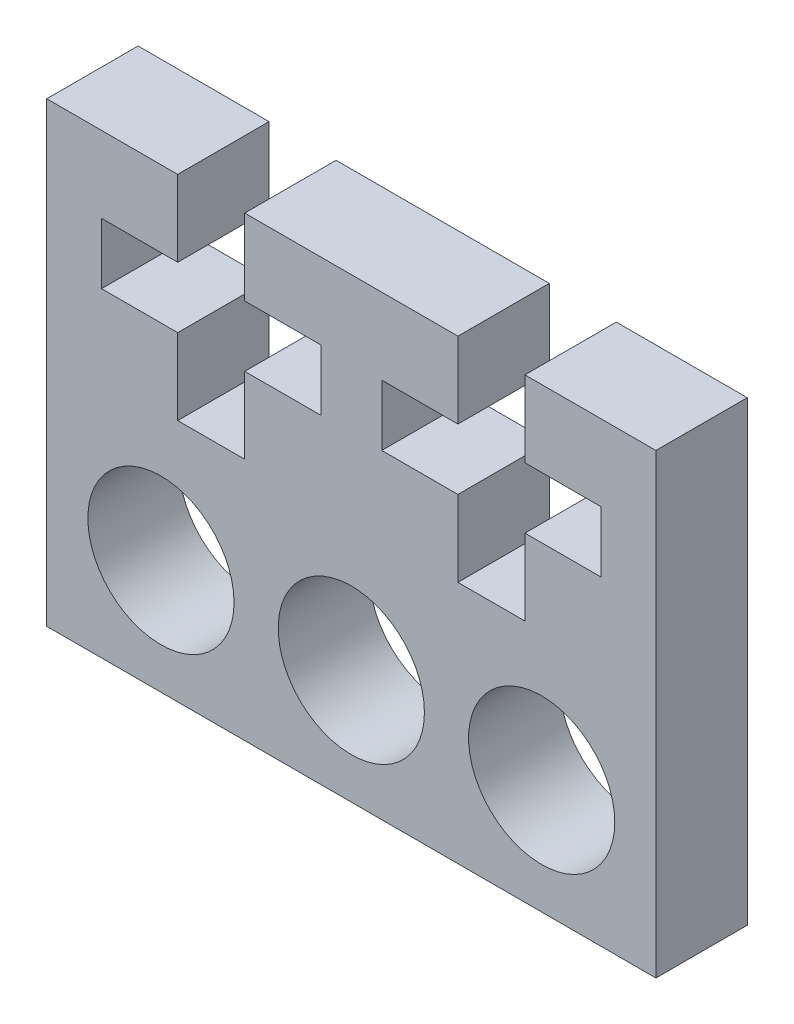
ISO-10303-21;
HEADER;
FILE_DESCRIPTION(('STEP AP214'),'2;1');
FILE_NAME('part.step','',(''),(''),'','','');
FILE_SCHEMA(('AUTOMOTIVE_DESIGN { 1 0 10303 214 1 1 1 1 }'));
ENDSEC;
DATA;
#1=APPLICATION_CONTEXT('core data for automotive mechanical design processes');
#2=APPLICATION_PROTOCOL_DEFINITION('international standard','automotive_design',2000,#1);
#3=PRODUCT_CONTEXT('',#1,'mechanical');
#4=PRODUCT('Part','Part','',(#3));
#5=PRODUCT_RELATED_PRODUCT_CATEGORY('part','',(#4));
#6=PRODUCT_DEFINITION_FORMATION('','',#4);
#7=PRODUCT_DEFINITION_CONTEXT('part definition',#1,'design');
#8=PRODUCT_DEFINITION('design','',#6,#7);
#9=PRODUCT_DEFINITION_SHAPE('','',#8);
#10=(LENGTH_UNIT() NAMED_UNIT(*) SI_UNIT(.MILLI.,.METRE.));
#11=(NAMED_UNIT(*) PLANE_ANGLE_UNIT() SI_UNIT($,.RADIAN.));
#12=(NAMED_UNIT(*) SI_UNIT($,.STERADIAN.) SOLID_ANGLE_UNIT());
#13=UNCERTAINTY_MEASURE_WITH_UNIT(LENGTH_MEASURE(1.E-05),#10,'distance_accuracy_value','');
#14=(GEOMETRIC_REPRESENTATION_CONTEXT(3) GLOBAL_UNCERTAINTY_ASSIGNED_CONTEXT((#13)) GLOBAL_UNIT_ASSIGNED_CONTEXT((#10,
#11,#12)) REPRESENTATION_CONTEXT('',''));
#15=CARTESIAN_POINT('',(0.,0.,0.));
#16=DIRECTION('',(0.,0.,1.));
#17=DIRECTION('',(1.,0.,0.));
#18=AXIS2_PLACEMENT_3D('',#15,#16,#17);
#19=CARTESIAN_POINT('',(0.,7.50000000000001,3.));
#20=DIRECTION('',(0.,1.,0.));
#21=DIRECTION('',(-1.,0.,0.));
#22=AXIS2_PLACEMENT_3D('',#19,#20,#21);
#23=PLANE('',#22);
#24=DIRECTION('',(1.,0.,0.));
#25=VECTOR('',#24,1.);
#26=CARTESIAN_POINT('',(0.,7.50000000000001,0.));
#27=LINE('',#26,#25);
#28=CARTESIAN_POINT('',(5.7,7.5,0.));
#29=VERTEX_POINT('',#28);
#30=CARTESIAN_POINT('',(10.,7.5,0.));
#31=VERTEX_POINT('',#30);
#32=EDGE_CURVE('E265',#29,#31,#27,.T.);
#33=ORIENTED_EDGE('',*,*,#32,.F.);
#34=DIRECTION('',(0.,0.,-1.));
#35=VECTOR('',#34,1.);
#36=CARTESIAN_POINT('',(5.7,7.5,3.));
#37=LINE('',#36,#35);
#38=CARTESIAN_POINT('',(5.7,7.5,3.));
#39=VERTEX_POINT('',#38);
#40=EDGE_CURVE('E11',#39,#29,#37,.T.);
#41=ORIENTED_EDGE('',*,*,#40,.F.);
#42=DIRECTION('',(1.,0.,0.));
#43=VECTOR('',#42,1.);
#44=CARTESIAN_POINT('',(0.,7.50000000000001,3.));
#45=LINE('',#44,#43);
#46=CARTESIAN_POINT('',(10.,7.5,3.));
#47=VERTEX_POINT('',#46);
#48=EDGE_CURVE('E832',#39,#47,#45,.T.);
#49=ORIENTED_EDGE('',*,*,#48,.T.);
#50=DIRECTION('',(0.,0.,-1.));
#51=VECTOR('',#50,1.);
#52=CARTESIAN_POINT('',(10.,7.5,3.));
#53=LINE('',#52,#51);
#54=EDGE_CURVE('E149',#47,#31,#53,.T.);
#55=ORIENTED_EDGE('',*,*,#54,.T.);
#56=EDGE_LOOP('',(#33,#41,#49,#55));
#57=FACE_BOUND('',#56,.T.);
#58=ADVANCED_FACE('F37',(#57),#23,.T.);
#59=CARTESIAN_POINT('',(5.7,0.,3.));
#60=DIRECTION('',(1.,0.,0.));
#61=DIRECTION('',(0.,0.,-1.));
#62=AXIS2_PLACEMENT_3D('',#59,#60,#61);
#63=PLANE('',#62);
#64=DIRECTION('',(0.,-1.,0.));
#65=VECTOR('',#64,1.);
#66=CARTESIAN_POINT('',(5.7,0.,0.));
#67=LINE('',#66,#65);
#68=CARTESIAN_POINT('',(5.7,5.,0.));
#69=VERTEX_POINT('',#68);
#70=EDGE_CURVE('E267',#29,#69,#67,.T.);
#71=ORIENTED_EDGE('',*,*,#70,.T.);
#72=DIRECTION('',(0.,0.,-1.));
#73=VECTOR('',#72,1.);
#74=CARTESIAN_POINT('',(5.7,5.,3.));
#75=LINE('',#74,#73);
#76=CARTESIAN_POINT('',(5.7,5.,3.));
#77=VERTEX_POINT('',#76);
#78=EDGE_CURVE('E46',#77,#69,#75,.T.);
#79=ORIENTED_EDGE('',*,*,#78,.F.);
#80=DIRECTION('',(0.,-1.,0.));
#81=VECTOR('',#80,1.);
#82=CARTESIAN_POINT('',(5.7,0.,3.));
#83=LINE('',#82,#81);
#84=EDGE_CURVE('E745',#39,#77,#83,.T.);
#85=ORIENTED_EDGE('',*,*,#84,.F.);
#86=ORIENTED_EDGE('',*,*,#40,.T.);
#87=EDGE_LOOP('',(#71,#79,#85,#86));
#88=FACE_BOUND('',#87,.T.);
#89=ADVANCED_FACE('F409',(#88),#63,.F.);
#90=CARTESIAN_POINT('',(0.,5.,3.));
#91=DIRECTION('',(0.,1.,0.));
#92=DIRECTION('',(0.,0.,1.));
#93=AXIS2_PLACEMENT_3D('',#90,#91,#92);
#94=PLANE('',#93);
#95=DIRECTION('',(1.,0.,0.));
#96=VECTOR('',#95,1.);
#97=CARTESIAN_POINT('',(0.,5.,0.));
#98=LINE('',#97,#96);
#99=CARTESIAN_POINT('',(8.2,5.,0.));
#100=VERTEX_POINT('',#99);
#101=EDGE_CURVE('E270',#69,#100,#98,.T.);
#102=ORIENTED_EDGE('',*,*,#101,.T.);
#103=DIRECTION('',(0.,0.,-1.));
#104=VECTOR('',#103,1.);
#105=CARTESIAN_POINT('',(8.2,5.,3.));
#106=LINE('',#105,#104);
#107=CARTESIAN_POINT('',(8.2,5.,3.));
#108=VERTEX_POINT('',#107);
#109=EDGE_CURVE('E397',#108,#100,#106,.T.);
#110=ORIENTED_EDGE('',*,*,#109,.F.);
#111=DIRECTION('',(1.,0.,0.));
#112=VECTOR('',#111,1.);
#113=CARTESIAN_POINT('',(0.,5.,3.));
#114=LINE('',#113,#112);
#115=EDGE_CURVE('E405',#77,#108,#114,.T.);
#116=ORIENTED_EDGE('',*,*,#115,.F.);
#117=ORIENTED_EDGE('',*,*,#78,.T.);
#118=EDGE_LOOP('',(#102,#110,#116,#117));
#119=FACE_BOUND('',#118,.T.);
#120=ADVANCED_FACE('F402',(#119),#94,.F.);
#121=CARTESIAN_POINT('',(8.2,0.,3.));
#122=DIRECTION('',(1.,0.,0.));
#123=DIRECTION('',(0.,0.,-1.));
#124=AXIS2_PLACEMENT_3D('',#121,#122,#123);
#125=PLANE('',#124);
#126=DIRECTION('',(0.,-1.,0.));
#127=VECTOR('',#126,1.);
#128=CARTESIAN_POINT('',(8.2,0.,0.));
#129=LINE('',#128,#127);
#130=CARTESIAN_POINT('',(8.2,3.,0.));
#131=VERTEX_POINT('',#130);
#132=EDGE_CURVE('E273',#100,#131,#129,.T.);
#133=ORIENTED_EDGE('',*,*,#132,.T.);
#134=DIRECTION('',(0.,0.,-1.));
#135=VECTOR('',#134,1.);
#136=CARTESIAN_POINT('',(8.2,3.,3.));
#137=LINE('',#136,#135);
#138=CARTESIAN_POINT('',(8.2,3.,3.));
#139=VERTEX_POINT('',#138);
#140=EDGE_CURVE('E394',#139,#131,#137,.T.);
#141=ORIENTED_EDGE('',*,*,#140,.F.);
#142=DIRECTION('',(0.,-1.,0.));
#143=VECTOR('',#142,1.);
#144=CARTESIAN_POINT('',(8.2,0.,3.));
#145=LINE('',#144,#143);
#146=EDGE_CURVE('E742',#108,#139,#145,.T.);
#147=ORIENTED_EDGE('',*,*,#146,.F.);
#148=ORIENTED_EDGE('',*,*,#109,.T.);
#149=EDGE_LOOP('',(#133,#141,#147,#148));
#150=FACE_BOUND('',#149,.T.);
#151=ADVANCED_FACE('F538',(#150),#125,.F.);
#152=CARTESIAN_POINT('',(0.,3.,3.));
#153=DIRECTION('',(0.,-1.,0.));
#154=DIRECTION('',(0.,0.,-1.));
#155=AXIS2_PLACEMENT_3D('',#152,#153,#154);
#156=PLANE('',#155);
#157=DIRECTION('',(-1.,0.,0.));
#158=VECTOR('',#157,1.);
#159=CARTESIAN_POINT('',(0.,3.,0.));
#160=LINE('',#159,#158);
#161=CARTESIAN_POINT('',(5.7,3.,0.));
#162=VERTEX_POINT('',#161);
#163=EDGE_CURVE('E276',#131,#162,#160,.T.);
#164=ORIENTED_EDGE('',*,*,#163,.T.);
#165=DIRECTION('',(0.,0.,-1.));
#166=VECTOR('',#165,1.);
#167=CARTESIAN_POINT('',(5.7,3.,3.));
#168=LINE('',#167,#166);
#169=CARTESIAN_POINT('',(5.7,3.,3.));
#170=VERTEX_POINT('',#169);
#171=EDGE_CURVE('E391',#170,#162,#168,.T.);
#172=ORIENTED_EDGE('',*,*,#171,.F.);
#173=DIRECTION('',(-1.,0.,0.));
#174=VECTOR('',#173,1.);
#175=CARTESIAN_POINT('',(0.,3.,3.));
#176=LINE('',#175,#174);
#177=EDGE_CURVE('E738',#139,#170,#176,.T.);
#178=ORIENTED_EDGE('',*,*,#177,.F.);
#179=ORIENTED_EDGE('',*,*,#140,.T.);
#180=EDGE_LOOP('',(#164,#172,#178,#179));
#181=FACE_BOUND('',#180,.T.);
#182=ADVANCED_FACE('F534',(#181),#156,.F.);
#183=CARTESIAN_POINT('',(5.7,0.,3.));
#184=DIRECTION('',(1.,0.,0.));
#185=DIRECTION('',(0.,0.,-1.));
#186=AXIS2_PLACEMENT_3D('',#183,#184,#185);
#187=PLANE('',#186);
#188=DIRECTION('',(0.,-1.,0.));
#189=VECTOR('',#188,1.);
#190=CARTESIAN_POINT('',(5.7,0.,0.));
#191=LINE('',#190,#189);
#192=CARTESIAN_POINT('',(5.7,0.500000000000003,0.));
#193=VERTEX_POINT('',#192);
#194=EDGE_CURVE('E279',#162,#193,#191,.T.);
#195=ORIENTED_EDGE('',*,*,#194,.T.);
#196=DIRECTION('',(0.,0.,-1.));
#197=VECTOR('',#196,1.);
#198=CARTESIAN_POINT('',(5.7,0.500000000000003,3.));
#199=LINE('',#198,#197);
#200=CARTESIAN_POINT('',(5.7,0.500000000000003,3.));
#201=VERTEX_POINT('',#200);
#202=EDGE_CURVE('E388',#201,#193,#199,.T.);
#203=ORIENTED_EDGE('',*,*,#202,.F.);
#204=DIRECTION('',(0.,-1.,0.));
#205=VECTOR('',#204,1.);
#206=CARTESIAN_POINT('',(5.7,0.,3.));
#207=LINE('',#206,#205);
#208=EDGE_CURVE('E741',#170,#201,#207,.T.);
#209=ORIENTED_EDGE('',*,*,#208,.F.);
#210=ORIENTED_EDGE('',*,*,#171,.T.);
#211=EDGE_LOOP('',(#195,#203,#209,#210));
#212=FACE_BOUND('',#211,.T.);
#213=ADVANCED_FACE('F530',(#212),#187,.F.);
#214=CARTESIAN_POINT('',(0.,0.499999999999998,3.));
#215=DIRECTION('',(0.,-1.,0.));
#216=DIRECTION('',(1.,0.,0.));
#217=AXIS2_PLACEMENT_3D('',#214,#215,#216);
#218=PLANE('',#217);
#219=DIRECTION('',(-1.,0.,0.));
#220=VECTOR('',#219,1.);
#221=CARTESIAN_POINT('',(0.,0.499999999999998,0.));
#222=LINE('',#221,#220);
#223=CARTESIAN_POINT('',(3.50000000000001,0.500000000000001,0.));
#224=VERTEX_POINT('',#223);
#225=EDGE_CURVE('E282',#193,#224,#222,.T.);
#226=ORIENTED_EDGE('',*,*,#225,.T.);
#227=DIRECTION('',(0.,0.,-1.));
#228=VECTOR('',#227,1.);
#229=CARTESIAN_POINT('',(3.50000000000001,0.500000000000001,3.));
#230=LINE('',#229,#228);
#231=CARTESIAN_POINT('',(3.50000000000001,0.500000000000001,3.));
#232=VERTEX_POINT('',#231);
#233=EDGE_CURVE('E385',#232,#224,#230,.T.);
#234=ORIENTED_EDGE('',*,*,#233,.F.);
#235=DIRECTION('',(-1.,0.,0.));
#236=VECTOR('',#235,1.);
#237=CARTESIAN_POINT('',(0.,0.499999999999998,3.));
#238=LINE('',#237,#236);
#239=EDGE_CURVE('E750',#201,#232,#238,.T.);
#240=ORIENTED_EDGE('',*,*,#239,.F.);
#241=ORIENTED_EDGE('',*,*,#202,.T.);
#242=EDGE_LOOP('',(#226,#234,#240,#241));
#243=FACE_BOUND('',#242,.T.);
#244=ADVANCED_FACE('F526',(#243),#218,.F.);
#245=CARTESIAN_POINT('',(3.50000000000001,0.,3.));
#246=DIRECTION('',(-1.,0.,0.));
#247=DIRECTION('',(0.,-1.,0.));
#248=AXIS2_PLACEMENT_3D('',#245,#246,#247);
#249=PLANE('',#248);
#250=DIRECTION('',(0.,1.,0.));
#251=VECTOR('',#250,1.);
#252=CARTESIAN_POINT('',(3.50000000000001,0.,0.));
#253=LINE('',#252,#251);
#254=CARTESIAN_POINT('',(3.5,3.,0.));
#255=VERTEX_POINT('',#254);
#256=EDGE_CURVE('E285',#224,#255,#253,.T.);
#257=ORIENTED_EDGE('',*,*,#256,.T.);
#258=DIRECTION('',(0.,0.,-1.));
#259=VECTOR('',#258,1.);
#260=CARTESIAN_POINT('',(3.5,3.,3.));
#261=LINE('',#260,#259);
#262=CARTESIAN_POINT('',(3.5,3.,3.));
#263=VERTEX_POINT('',#262);
#264=EDGE_CURVE('E382',#263,#255,#261,.T.);
#265=ORIENTED_EDGE('',*,*,#264,.F.);
#266=DIRECTION('',(0.,1.,0.));
#267=VECTOR('',#266,1.);
#268=CARTESIAN_POINT('',(3.50000000000001,0.,3.));
#269=LINE('',#268,#267);
#270=EDGE_CURVE('E753',#232,#263,#269,.T.);
#271=ORIENTED_EDGE('',*,*,#270,.F.);
#272=ORIENTED_EDGE('',*,*,#233,.T.);
#273=EDGE_LOOP('',(#257,#265,#271,#272));
#274=FACE_BOUND('',#273,.T.);
#275=ADVANCED_FACE('F522',(#274),#249,.F.);
#276=CARTESIAN_POINT('',(0.,3.,3.));
#277=DIRECTION('',(0.,-1.,0.));
#278=DIRECTION('',(0.,0.,-1.));
#279=AXIS2_PLACEMENT_3D('',#276,#277,#278);
#280=PLANE('',#279);
#281=DIRECTION('',(-1.,0.,0.));
#282=VECTOR('',#281,1.);
#283=CARTESIAN_POINT('',(0.,3.,0.));
#284=LINE('',#283,#282);
#285=CARTESIAN_POINT('',(1.,3.,0.));
#286=VERTEX_POINT('',#285);
#287=EDGE_CURVE('E288',#255,#286,#284,.T.);
#288=ORIENTED_EDGE('',*,*,#287,.T.);
#289=DIRECTION('',(0.,0.,-1.));
#290=VECTOR('',#289,1.);
#291=CARTESIAN_POINT('',(1.,3.,3.));
#292=LINE('',#291,#290);
#293=CARTESIAN_POINT('',(1.,3.,3.));
#294=VERTEX_POINT('',#293);
#295=EDGE_CURVE('E379',#294,#286,#292,.T.);
#296=ORIENTED_EDGE('',*,*,#295,.F.);
#297=DIRECTION('',(-1.,0.,0.));
#298=VECTOR('',#297,1.);
#299=CARTESIAN_POINT('',(0.,3.,3.));
#300=LINE('',#299,#298);
#301=EDGE_CURVE('E756',#263,#294,#300,.T.);
#302=ORIENTED_EDGE('',*,*,#301,.F.);
#303=ORIENTED_EDGE('',*,*,#264,.T.);
#304=EDGE_LOOP('',(#288,#296,#302,#303));
#305=FACE_BOUND('',#304,.T.);
#306=ADVANCED_FACE('F518',(#305),#280,.F.);
#307=CARTESIAN_POINT('',(1.,0.,3.));
#308=DIRECTION('',(-1.,0.,0.));
#309=DIRECTION('',(0.,-1.,0.));
#310=AXIS2_PLACEMENT_3D('',#307,#308,#309);
#311=PLANE('',#310);
#312=DIRECTION('',(0.,1.,0.));
#313=VECTOR('',#312,1.);
#314=CARTESIAN_POINT('',(1.,0.,0.));
#315=LINE('',#314,#313);
#316=CARTESIAN_POINT('',(1.,5.,0.));
#317=VERTEX_POINT('',#316);
#318=EDGE_CURVE('E291',#286,#317,#315,.T.);
#319=ORIENTED_EDGE('',*,*,#318,.T.);
#320=DIRECTION('',(0.,0.,-1.));
#321=VECTOR('',#320,1.);
#322=CARTESIAN_POINT('',(1.,5.,3.));
#323=LINE('',#322,#321);
#324=CARTESIAN_POINT('',(1.,5.,3.));
#325=VERTEX_POINT('',#324);
#326=EDGE_CURVE('E376',#325,#317,#323,.T.);
#327=ORIENTED_EDGE('',*,*,#326,.F.);
#328=DIRECTION('',(0.,1.,0.));
#329=VECTOR('',#328,1.);
#330=CARTESIAN_POINT('',(1.,0.,3.));
#331=LINE('',#330,#329);
#332=EDGE_CURVE('E759',#294,#325,#331,.T.);
#333=ORIENTED_EDGE('',*,*,#332,.F.);
#334=ORIENTED_EDGE('',*,*,#295,.T.);
#335=EDGE_LOOP('',(#319,#327,#333,#334));
#336=FACE_BOUND('',#335,.T.);
#337=ADVANCED_FACE('F514',(#336),#311,.F.);
#338=CARTESIAN_POINT('',(0.,5.,3.));
#339=DIRECTION('',(0.,1.,0.));
#340=DIRECTION('',(-1.,0.,0.));
#341=AXIS2_PLACEMENT_3D('',#338,#339,#340);
#342=PLANE('',#341);
#343=DIRECTION('',(1.,0.,0.));
#344=VECTOR('',#343,1.);
#345=CARTESIAN_POINT('',(0.,5.,0.));
#346=LINE('',#345,#344);
#347=CARTESIAN_POINT('',(3.5,5.,0.));
#348=VERTEX_POINT('',#347);
#349=EDGE_CURVE('E294',#317,#348,#346,.T.);
#350=ORIENTED_EDGE('',*,*,#349,.T.);
#351=DIRECTION('',(0.,0.,-1.));
#352=VECTOR('',#351,1.);
#353=CARTESIAN_POINT('',(3.5,5.,3.));
#354=LINE('',#353,#352);
#355=CARTESIAN_POINT('',(3.5,5.,3.));
#356=VERTEX_POINT('',#355);
#357=EDGE_CURVE('E373',#356,#348,#354,.T.);
#358=ORIENTED_EDGE('',*,*,#357,.F.);
#359=DIRECTION('',(1.,0.,0.));
#360=VECTOR('',#359,1.);
#361=CARTESIAN_POINT('',(0.,5.,3.));
#362=LINE('',#361,#360);
#363=EDGE_CURVE('E762',#325,#356,#362,.T.);
#364=ORIENTED_EDGE('',*,*,#363,.F.);
#365=ORIENTED_EDGE('',*,*,#326,.T.);
#366=EDGE_LOOP('',(#350,#358,#364,#365));
#367=FACE_BOUND('',#366,.T.);
#368=ADVANCED_FACE('F510',(#367),#342,.F.);
#369=CARTESIAN_POINT('',(3.5,0.,3.));
#370=DIRECTION('',(-1.,0.,0.));
#371=DIRECTION('',(0.,-1.,0.));
#372=AXIS2_PLACEMENT_3D('',#369,#370,#371);
#373=PLANE('',#372);
#374=DIRECTION('',(0.,1.,0.));
#375=VECTOR('',#374,1.);
#376=CARTESIAN_POINT('',(3.5,0.,0.));
#377=LINE('',#376,#375);
#378=CARTESIAN_POINT('',(3.5,7.5,0.));
#379=VERTEX_POINT('',#378);
#380=EDGE_CURVE('E297',#348,#379,#377,.T.);
#381=ORIENTED_EDGE('',*,*,#380,.T.);
#382=DIRECTION('',(0.,0.,-1.));
#383=VECTOR('',#382,1.);
#384=CARTESIAN_POINT('',(3.5,7.5,3.));
#385=LINE('',#384,#383);
#386=CARTESIAN_POINT('',(3.5,7.5,3.));
#387=VERTEX_POINT('',#386);
#388=EDGE_CURVE('E371',#387,#379,#385,.T.);
#389=ORIENTED_EDGE('',*,*,#388,.F.);
#390=DIRECTION('',(0.,1.,0.));
#391=VECTOR('',#390,1.);
#392=CARTESIAN_POINT('',(3.5,0.,3.));
#393=LINE('',#392,#391);
#394=EDGE_CURVE('E765',#356,#387,#393,.T.);
#395=ORIENTED_EDGE('',*,*,#394,.F.);
#396=ORIENTED_EDGE('',*,*,#357,.T.);
#397=EDGE_LOOP('',(#381,#389,#395,#396));
#398=FACE_BOUND('',#397,.T.);
#399=ADVANCED_FACE('F506',(#398),#373,.F.);
#400=CARTESIAN_POINT('',(0.,7.5,3.));
#401=DIRECTION('',(0.,1.,0.));
#402=DIRECTION('',(-1.,0.,0.));
#403=AXIS2_PLACEMENT_3D('',#400,#401,#402);
#404=PLANE('',#403);
#405=DIRECTION('',(1.,0.,0.));
#406=VECTOR('',#405,1.);
#407=CARTESIAN_POINT('',(0.,7.5,0.));
#408=LINE('',#407,#406);
#409=CARTESIAN_POINT('',(-3.5,7.5,0.));
#410=VERTEX_POINT('',#409);
#411=EDGE_CURVE('E300',#410,#379,#408,.T.);
#412=ORIENTED_EDGE('',*,*,#411,.F.);
#413=DIRECTION('',(0.,0.,-1.));
#414=VECTOR('',#413,1.);
#415=CARTESIAN_POINT('',(-3.5,7.5,3.));
#416=LINE('',#415,#414);
#417=CARTESIAN_POINT('',(-3.5,7.5,3.));
#418=VERTEX_POINT('',#417);
#419=EDGE_CURVE('E369',#418,#410,#416,.T.);
#420=ORIENTED_EDGE('',*,*,#419,.F.);
#421=DIRECTION('',(1.,0.,0.));
#422=VECTOR('',#421,1.);
#423=CARTESIAN_POINT('',(0.,7.5,3.));
#424=LINE('',#423,#422);
#425=EDGE_CURVE('E767',#418,#387,#424,.T.);
#426=ORIENTED_EDGE('',*,*,#425,.T.);
#427=ORIENTED_EDGE('',*,*,#388,.T.);
#428=EDGE_LOOP('',(#412,#420,#426,#427));
#429=FACE_BOUND('',#428,.T.);
#430=ADVANCED_FACE('F502',(#429),#404,.T.);
#431=CARTESIAN_POINT('',(-3.5,0.,3.));
#432=DIRECTION('',(-1.,0.,0.));
#433=DIRECTION('',(0.,0.,1.));
#434=AXIS2_PLACEMENT_3D('',#431,#432,#433);
#435=PLANE('',#434);
#436=DIRECTION('',(0.,1.,0.));
#437=VECTOR('',#436,1.);
#438=CARTESIAN_POINT('',(-3.5,0.,0.));
#439=LINE('',#438,#437);
#440=CARTESIAN_POINT('',(-3.5,5.,0.));
#441=VERTEX_POINT('',#440);
#442=EDGE_CURVE('E303',#441,#410,#439,.T.);
#443=ORIENTED_EDGE('',*,*,#442,.F.);
#444=DIRECTION('',(0.,0.,-1.));
#445=VECTOR('',#444,1.);
#446=CARTESIAN_POINT('',(-3.5,5.,3.));
#447=LINE('',#446,#445);
#448=CARTESIAN_POINT('',(-3.5,5.,3.));
#449=VERTEX_POINT('',#448);
#450=EDGE_CURVE('E367',#449,#441,#447,.T.);
#451=ORIENTED_EDGE('',*,*,#450,.F.);
#452=DIRECTION('',(0.,1.,0.));
#453=VECTOR('',#452,1.);
#454=CARTESIAN_POINT('',(-3.5,0.,3.));
#455=LINE('',#454,#453);
#456=EDGE_CURVE('E770',#449,#418,#455,.T.);
#457=ORIENTED_EDGE('',*,*,#456,.T.);
#458=ORIENTED_EDGE('',*,*,#419,.T.);
#459=EDGE_LOOP('',(#443,#451,#457,#458));
#460=FACE_BOUND('',#459,.T.);
#461=ADVANCED_FACE('F498',(#460),#435,.T.);
#462=CARTESIAN_POINT('',(0.,5.,3.));
#463=DIRECTION('',(0.,-1.,0.));
#464=DIRECTION('',(0.,0.,-1.));
#465=AXIS2_PLACEMENT_3D('',#462,#463,#464);
#466=PLANE('',#465);
#467=DIRECTION('',(-1.,0.,0.));
#468=VECTOR('',#467,1.);
#469=CARTESIAN_POINT('',(0.,5.,0.));
#470=LINE('',#469,#468);
#471=CARTESIAN_POINT('',(-1.,5.,0.));
#472=VERTEX_POINT('',#471);
#473=EDGE_CURVE('E306',#472,#441,#470,.T.);
#474=ORIENTED_EDGE('',*,*,#473,.F.);
#475=DIRECTION('',(0.,0.,-1.));
#476=VECTOR('',#475,1.);
#477=CARTESIAN_POINT('',(-1.,5.,3.));
#478=LINE('',#477,#476);
#479=CARTESIAN_POINT('',(-1.,5.,3.));
#480=VERTEX_POINT('',#479);
#481=EDGE_CURVE('E365',#480,#472,#478,.T.);
#482=ORIENTED_EDGE('',*,*,#481,.F.);
#483=DIRECTION('',(-1.,0.,0.));
#484=VECTOR('',#483,1.);
#485=CARTESIAN_POINT('',(0.,5.,3.));
#486=LINE('',#485,#484);
#487=EDGE_CURVE('E773',#480,#449,#486,.T.);
#488=ORIENTED_EDGE('',*,*,#487,.T.);
#489=ORIENTED_EDGE('',*,*,#450,.T.);
#490=EDGE_LOOP('',(#474,#482,#488,#489));
#491=FACE_BOUND('',#490,.T.);
#492=ADVANCED_FACE('F494',(#491),#466,.T.);
#493=CARTESIAN_POINT('',(-1.,0.,3.));
#494=DIRECTION('',(-1.,0.,0.));
#495=DIRECTION('',(0.,0.,1.));
#496=AXIS2_PLACEMENT_3D('',#493,#494,#495);
#497=PLANE('',#496);
#498=DIRECTION('',(0.,1.,0.));
#499=VECTOR('',#498,1.);
#500=CARTESIAN_POINT('',(-1.,0.,0.));
#501=LINE('',#500,#499);
#502=CARTESIAN_POINT('',(-1.,3.,0.));
#503=VERTEX_POINT('',#502);
#504=EDGE_CURVE('E309',#503,#472,#501,.T.);
#505=ORIENTED_EDGE('',*,*,#504,.F.);
#506=DIRECTION('',(0.,0.,-1.));
#507=VECTOR('',#506,1.);
#508=CARTESIAN_POINT('',(-1.,3.,3.));
#509=LINE('',#508,#507);
#510=CARTESIAN_POINT('',(-1.,3.,3.));
#511=VERTEX_POINT('',#510);
#512=EDGE_CURVE('E363',#511,#503,#509,.T.);
#513=ORIENTED_EDGE('',*,*,#512,.F.);
#514=DIRECTION('',(0.,1.,0.));
#515=VECTOR('',#514,1.);
#516=CARTESIAN_POINT('',(-1.,0.,3.));
#517=LINE('',#516,#515);
#518=EDGE_CURVE('E776',#511,#480,#517,.T.);
#519=ORIENTED_EDGE('',*,*,#518,.T.);
#520=ORIENTED_EDGE('',*,*,#481,.T.);
#521=EDGE_LOOP('',(#505,#513,#519,#520));
#522=FACE_BOUND('',#521,.T.);
#523=ADVANCED_FACE('F490',(#522),#497,.T.);
#524=CARTESIAN_POINT('',(0.,3.,3.));
#525=DIRECTION('',(0.,1.,0.));
#526=DIRECTION('',(0.,0.,1.));
#527=AXIS2_PLACEMENT_3D('',#524,#525,#526);
#528=PLANE('',#527);
#529=DIRECTION('',(1.,0.,0.));
#530=VECTOR('',#529,1.);
#531=CARTESIAN_POINT('',(0.,3.,0.));
#532=LINE('',#531,#530);
#533=CARTESIAN_POINT('',(-3.5,3.,0.));
#534=VERTEX_POINT('',#533);
#535=EDGE_CURVE('E312',#534,#503,#532,.T.);
#536=ORIENTED_EDGE('',*,*,#535,.F.);
#537=DIRECTION('',(0.,0.,-1.));
#538=VECTOR('',#537,1.);
#539=CARTESIAN_POINT('',(-3.5,3.,3.));
#540=LINE('',#539,#538);
#541=CARTESIAN_POINT('',(-3.5,3.,3.));
#542=VERTEX_POINT('',#541);
#543=EDGE_CURVE('E361',#542,#534,#540,.T.);
#544=ORIENTED_EDGE('',*,*,#543,.F.);
#545=DIRECTION('',(1.,0.,0.));
#546=VECTOR('',#545,1.);
#547=CARTESIAN_POINT('',(0.,3.,3.));
#548=LINE('',#547,#546);
#549=EDGE_CURVE('E779',#542,#511,#548,.T.);
#550=ORIENTED_EDGE('',*,*,#549,.T.);
#551=ORIENTED_EDGE('',*,*,#512,.T.);
#552=EDGE_LOOP('',(#536,#544,#550,#551));
#553=FACE_BOUND('',#552,.T.);
#554=ADVANCED_FACE('F486',(#553),#528,.T.);
#555=CARTESIAN_POINT('',(-3.5,0.,3.));
#556=DIRECTION('',(-1.,0.,0.));
#557=DIRECTION('',(0.,0.,1.));
#558=AXIS2_PLACEMENT_3D('',#555,#556,#557);
#559=PLANE('',#558);
#560=DIRECTION('',(0.,1.,0.));
#561=VECTOR('',#560,1.);
#562=CARTESIAN_POINT('',(-3.5,0.,0.));
#563=LINE('',#562,#561);
#564=CARTESIAN_POINT('',(-3.5,0.500000000000001,0.));
#565=VERTEX_POINT('',#564);
#566=EDGE_CURVE('E315',#565,#534,#563,.T.);
#567=ORIENTED_EDGE('',*,*,#566,.F.);
#568=DIRECTION('',(0.,0.,-1.));
#569=VECTOR('',#568,1.);
#570=CARTESIAN_POINT('',(-3.5,0.500000000000001,3.));
#571=LINE('',#570,#569);
#572=CARTESIAN_POINT('',(-3.5,0.500000000000001,3.));
#573=VERTEX_POINT('',#572);
#574=EDGE_CURVE('E359',#573,#565,#571,.T.);
#575=ORIENTED_EDGE('',*,*,#574,.F.);
#576=DIRECTION('',(0.,1.,0.));
#577=VECTOR('',#576,1.);
#578=CARTESIAN_POINT('',(-3.5,0.,3.));
#579=LINE('',#578,#577);
#580=EDGE_CURVE('E782',#573,#542,#579,.T.);
#581=ORIENTED_EDGE('',*,*,#580,.T.);
#582=ORIENTED_EDGE('',*,*,#543,.T.);
#583=EDGE_LOOP('',(#567,#575,#581,#582));
#584=FACE_BOUND('',#583,.T.);
#585=ADVANCED_FACE('F482',(#584),#559,.T.);
#586=CARTESIAN_POINT('',(0.,0.500000000000001,3.));
#587=DIRECTION('',(0.,1.,0.));
#588=DIRECTION('',(0.,0.,1.));
#589=AXIS2_PLACEMENT_3D('',#586,#587,#588);
#590=PLANE('',#589);
#591=DIRECTION('',(1.,0.,0.));
#592=VECTOR('',#591,1.);
#593=CARTESIAN_POINT('',(0.,0.500000000000001,0.));
#594=LINE('',#593,#592);
#595=CARTESIAN_POINT('',(-5.7,0.500000000000001,0.));
#596=VERTEX_POINT('',#595);
#597=EDGE_CURVE('E318',#596,#565,#594,.T.);
#598=ORIENTED_EDGE('',*,*,#597,.F.);
#599=DIRECTION('',(0.,0.,-1.));
#600=VECTOR('',#599,1.);
#601=CARTESIAN_POINT('',(-5.7,0.500000000000001,3.));
#602=LINE('',#601,#600);
#603=CARTESIAN_POINT('',(-5.7,0.500000000000001,3.));
#604=VERTEX_POINT('',#603);
#605=EDGE_CURVE('E357',#604,#596,#602,.T.);
#606=ORIENTED_EDGE('',*,*,#605,.F.);
#607=DIRECTION('',(1.,0.,0.));
#608=VECTOR('',#607,1.);
#609=CARTESIAN_POINT('',(0.,0.500000000000001,3.));
#610=LINE('',#609,#608);
#611=EDGE_CURVE('E785',#604,#573,#610,.T.);
#612=ORIENTED_EDGE('',*,*,#611,.T.);
#613=ORIENTED_EDGE('',*,*,#574,.T.);
#614=EDGE_LOOP('',(#598,#606,#612,#613));
#615=FACE_BOUND('',#614,.T.);
#616=ADVANCED_FACE('F478',(#615),#590,.T.);
#617=CARTESIAN_POINT('',(-5.7,0.,3.));
#618=DIRECTION('',(1.,0.,0.));
#619=DIRECTION('',(0.,0.,-1.));
#620=AXIS2_PLACEMENT_3D('',#617,#618,#619);
#621=PLANE('',#620);
#622=DIRECTION('',(0.,-1.,0.));
#623=VECTOR('',#622,1.);
#624=CARTESIAN_POINT('',(-5.7,0.,0.));
#625=LINE('',#624,#623);
#626=CARTESIAN_POINT('',(-5.7,3.,0.));
#627=VERTEX_POINT('',#626);
#628=EDGE_CURVE('E321',#627,#596,#625,.T.);
#629=ORIENTED_EDGE('',*,*,#628,.F.);
#630=DIRECTION('',(0.,0.,-1.));
#631=VECTOR('',#630,1.);
#632=CARTESIAN_POINT('',(-5.7,3.,3.));
#633=LINE('',#632,#631);
#634=CARTESIAN_POINT('',(-5.7,3.,3.));
#635=VERTEX_POINT('',#634);
#636=EDGE_CURVE('E355',#635,#627,#633,.T.);
#637=ORIENTED_EDGE('',*,*,#636,.F.);
#638=DIRECTION('',(0.,-1.,0.));
#639=VECTOR('',#638,1.);
#640=CARTESIAN_POINT('',(-5.7,0.,3.));
#641=LINE('',#640,#639);
#642=EDGE_CURVE('E788',#635,#604,#641,.T.);
#643=ORIENTED_EDGE('',*,*,#642,.T.);
#644=ORIENTED_EDGE('',*,*,#605,.T.);
#645=EDGE_LOOP('',(#629,#637,#643,#644));
#646=FACE_BOUND('',#645,.T.);
#647=ADVANCED_FACE('F474',(#646),#621,.T.);
#648=CARTESIAN_POINT('',(0.,3.,3.));
#649=DIRECTION('',(0.,1.,0.));
#650=DIRECTION('',(0.,0.,1.));
#651=AXIS2_PLACEMENT_3D('',#648,#649,#650);
#652=PLANE('',#651);
#653=DIRECTION('',(1.,0.,0.));
#654=VECTOR('',#653,1.);
#655=CARTESIAN_POINT('',(0.,3.,0.));
#656=LINE('',#655,#654);
#657=CARTESIAN_POINT('',(-8.2,3.,0.));
#658=VERTEX_POINT('',#657);
#659=EDGE_CURVE('E324',#658,#627,#656,.T.);
#660=ORIENTED_EDGE('',*,*,#659,.F.);
#661=DIRECTION('',(0.,0.,-1.));
#662=VECTOR('',#661,1.);
#663=CARTESIAN_POINT('',(-8.2,3.,3.));
#664=LINE('',#663,#662);
#665=CARTESIAN_POINT('',(-8.2,3.,3.));
#666=VERTEX_POINT('',#665);
#667=EDGE_CURVE('E353',#666,#658,#664,.T.);
#668=ORIENTED_EDGE('',*,*,#667,.F.);
#669=DIRECTION('',(1.,0.,0.));
#670=VECTOR('',#669,1.);
#671=CARTESIAN_POINT('',(0.,3.,3.));
#672=LINE('',#671,#670);
#673=EDGE_CURVE('E791',#666,#635,#672,.T.);
#674=ORIENTED_EDGE('',*,*,#673,.T.);
#675=ORIENTED_EDGE('',*,*,#636,.T.);
#676=EDGE_LOOP('',(#660,#668,#674,#675));
#677=FACE_BOUND('',#676,.T.);
#678=ADVANCED_FACE('F470',(#677),#652,.T.);
#679=CARTESIAN_POINT('',(-8.2,0.,3.));
#680=DIRECTION('',(1.,0.,0.));
#681=DIRECTION('',(0.,0.,-1.));
#682=AXIS2_PLACEMENT_3D('',#679,#680,#681);
#683=PLANE('',#682);
#684=DIRECTION('',(0.,-1.,0.));
#685=VECTOR('',#684,1.);
#686=CARTESIAN_POINT('',(-8.2,0.,0.));
#687=LINE('',#686,#685);
#688=CARTESIAN_POINT('',(-8.2,5.,0.));
#689=VERTEX_POINT('',#688);
#690=EDGE_CURVE('E327',#689,#658,#687,.T.);
#691=ORIENTED_EDGE('',*,*,#690,.F.);
#692=DIRECTION('',(0.,0.,-1.));
#693=VECTOR('',#692,1.);
#694=CARTESIAN_POINT('',(-8.2,5.,3.));
#695=LINE('',#694,#693);
#696=CARTESIAN_POINT('',(-8.2,5.,3.));
#697=VERTEX_POINT('',#696);
#698=EDGE_CURVE('E351',#697,#689,#695,.T.);
#699=ORIENTED_EDGE('',*,*,#698,.F.);
#700=DIRECTION('',(0.,-1.,0.));
#701=VECTOR('',#700,1.);
#702=CARTESIAN_POINT('',(-8.2,0.,3.));
#703=LINE('',#702,#701);
#704=EDGE_CURVE('E794',#697,#666,#703,.T.);
#705=ORIENTED_EDGE('',*,*,#704,.T.);
#706=ORIENTED_EDGE('',*,*,#667,.T.);
#707=EDGE_LOOP('',(#691,#699,#705,#706));
#708=FACE_BOUND('',#707,.T.);
#709=ADVANCED_FACE('F466',(#708),#683,.T.);
#710=CARTESIAN_POINT('',(0.,5.,3.));
#711=DIRECTION('',(0.,-1.,0.));
#712=DIRECTION('',(0.,0.,-1.));
#713=AXIS2_PLACEMENT_3D('',#710,#711,#712);
#714=PLANE('',#713);
#715=DIRECTION('',(-1.,0.,0.));
#716=VECTOR('',#715,1.);
#717=CARTESIAN_POINT('',(0.,5.,0.));
#718=LINE('',#717,#716);
#719=CARTESIAN_POINT('',(-5.7,5.,0.));
#720=VERTEX_POINT('',#719);
#721=EDGE_CURVE('E330',#720,#689,#718,.T.);
#722=ORIENTED_EDGE('',*,*,#721,.F.);
#723=DIRECTION('',(0.,0.,-1.));
#724=VECTOR('',#723,1.);
#725=CARTESIAN_POINT('',(-5.7,5.,3.));
#726=LINE('',#725,#724);
#727=CARTESIAN_POINT('',(-5.7,5.,3.));
#728=VERTEX_POINT('',#727);
#729=EDGE_CURVE('E349',#728,#720,#726,.T.);
#730=ORIENTED_EDGE('',*,*,#729,.F.);
#731=DIRECTION('',(-1.,0.,0.));
#732=VECTOR('',#731,1.);
#733=CARTESIAN_POINT('',(0.,5.,3.));
#734=LINE('',#733,#732);
#735=EDGE_CURVE('E797',#728,#697,#734,.T.);
#736=ORIENTED_EDGE('',*,*,#735,.T.);
#737=ORIENTED_EDGE('',*,*,#698,.T.);
#738=EDGE_LOOP('',(#722,#730,#736,#737));
#739=FACE_BOUND('',#738,.T.);
#740=ADVANCED_FACE('F462',(#739),#714,.T.);
#741=CARTESIAN_POINT('',(-5.7,0.,3.));
#742=DIRECTION('',(1.,0.,0.));
#743=DIRECTION('',(0.,0.,-1.));
#744=AXIS2_PLACEMENT_3D('',#741,#742,#743);
#745=PLANE('',#744);
#746=DIRECTION('',(0.,-1.,0.));
#747=VECTOR('',#746,1.);
#748=CARTESIAN_POINT('',(-5.7,0.,0.));
#749=LINE('',#748,#747);
#750=CARTESIAN_POINT('',(-5.7,7.5,0.));
#751=VERTEX_POINT('',#750);
#752=EDGE_CURVE('E333',#751,#720,#749,.T.);
#753=ORIENTED_EDGE('',*,*,#752,.F.);
#754=DIRECTION('',(0.,0.,-1.));
#755=VECTOR('',#754,1.);
#756=CARTESIAN_POINT('',(-5.7,7.5,3.));
#757=LINE('',#756,#755);
#758=CARTESIAN_POINT('',(-5.7,7.5,3.));
#759=VERTEX_POINT('',#758);
#760=EDGE_CURVE('E347',#759,#751,#757,.T.);
#761=ORIENTED_EDGE('',*,*,#760,.F.);
#762=DIRECTION('',(0.,-1.,0.));
#763=VECTOR('',#762,1.);
#764=CARTESIAN_POINT('',(-5.7,0.,3.));
#765=LINE('',#764,#763);
#766=EDGE_CURVE('E251',#759,#728,#765,.T.);
#767=ORIENTED_EDGE('',*,*,#766,.T.);
#768=ORIENTED_EDGE('',*,*,#729,.T.);
#769=EDGE_LOOP('',(#753,#761,#767,#768));
#770=FACE_BOUND('',#769,.T.);
#771=ADVANCED_FACE('F458',(#770),#745,.T.);
#772=CARTESIAN_POINT('',(0.,7.5,3.));
#773=DIRECTION('',(0.,1.,0.));
#774=DIRECTION('',(0.,0.,1.));
#775=AXIS2_PLACEMENT_3D('',#772,#773,#774);
#776=PLANE('',#775);
#777=DIRECTION('',(1.,0.,0.));
#778=VECTOR('',#777,1.);
#779=CARTESIAN_POINT('',(0.,7.5,0.));
#780=LINE('',#779,#778);
#781=CARTESIAN_POINT('',(-10.,7.5,0.));
#782=VERTEX_POINT('',#781);
#783=EDGE_CURVE('E336',#782,#751,#780,.T.);
#784=ORIENTED_EDGE('',*,*,#783,.F.);
#785=DIRECTION('',(0.,0.,-1.));
#786=VECTOR('',#785,1.);
#787=CARTESIAN_POINT('',(-10.,7.5,3.));
#788=LINE('',#787,#786);
#789=CARTESIAN_POINT('',(-10.,7.5,3.));
#790=VERTEX_POINT('',#789);
#791=EDGE_CURVE('E238',#790,#782,#788,.T.);
#792=ORIENTED_EDGE('',*,*,#791,.F.);
#793=DIRECTION('',(1.,0.,0.));
#794=VECTOR('',#793,1.);
#795=CARTESIAN_POINT('',(0.,7.5,3.));
#796=LINE('',#795,#794);
#797=EDGE_CURVE('E249',#790,#759,#796,.T.);
#798=ORIENTED_EDGE('',*,*,#797,.T.);
#799=ORIENTED_EDGE('',*,*,#760,.T.);
#800=EDGE_LOOP('',(#784,#792,#798,#799));
#801=FACE_BOUND('',#800,.T.);
#802=ADVANCED_FACE('F455',(#801),#776,.T.);
#803=CARTESIAN_POINT('',(-10.,0.,3.));
#804=DIRECTION('',(-1.,0.,0.));
#805=DIRECTION('',(0.,-1.,0.));
#806=AXIS2_PLACEMENT_3D('',#803,#804,#805);
#807=PLANE('',#806);
#808=DIRECTION('',(0.,1.,0.));
#809=VECTOR('',#808,1.);
#810=CARTESIAN_POINT('',(-10.,0.,0.));
#811=LINE('',#810,#809);
#812=CARTESIAN_POINT('',(-10.,-7.5,0.));
#813=VERTEX_POINT('',#812);
#814=EDGE_CURVE('E235',#813,#782,#811,.T.);
#815=ORIENTED_EDGE('',*,*,#814,.F.);
#816=DIRECTION('',(0.,0.,-1.));
#817=VECTOR('',#816,1.);
#818=CARTESIAN_POINT('',(-10.,-7.5,3.));
#819=LINE('',#818,#817);
#820=CARTESIAN_POINT('',(-10.,-7.5,3.));
#821=VERTEX_POINT('',#820);
#822=EDGE_CURVE('E229',#821,#813,#819,.T.);
#823=ORIENTED_EDGE('',*,*,#822,.F.);
#824=DIRECTION('',(0.,1.,0.));
#825=VECTOR('',#824,1.);
#826=CARTESIAN_POINT('',(-10.,0.,3.));
#827=LINE('',#826,#825);
#828=EDGE_CURVE('E233',#821,#790,#827,.T.);
#829=ORIENTED_EDGE('',*,*,#828,.T.);
#830=ORIENTED_EDGE('',*,*,#791,.T.);
#831=EDGE_LOOP('',(#815,#823,#829,#830));
#832=FACE_BOUND('',#831,.T.);
#833=ADVANCED_FACE('F231',(#832),#807,.T.);
#834=CARTESIAN_POINT('',(0.,-7.5,3.));
#835=DIRECTION('',(0.,1.,0.));
#836=DIRECTION('',(-1.,0.,0.));
#837=AXIS2_PLACEMENT_3D('',#834,#835,#836);
#838=PLANE('',#837);
#839=DIRECTION('',(1.,0.,0.));
#840=VECTOR('',#839,1.);
#841=CARTESIAN_POINT('',(0.,-7.5,0.));
#842=LINE('',#841,#840);
#843=CARTESIAN_POINT('',(10.,-7.5,0.));
#844=VERTEX_POINT('',#843);
#845=EDGE_CURVE('E340',#813,#844,#842,.T.);
#846=ORIENTED_EDGE('',*,*,#845,.T.);
#847=DIRECTION('',(0.,0.,-1.));
#848=VECTOR('',#847,1.);
#849=CARTESIAN_POINT('',(10.,-7.5,3.));
#850=LINE('',#849,#848);
#851=CARTESIAN_POINT('',(10.,-7.5,3.));
#852=VERTEX_POINT('',#851);
#853=EDGE_CURVE('E239',#852,#844,#850,.T.);
#854=ORIENTED_EDGE('',*,*,#853,.F.);
#855=DIRECTION('',(1.,0.,0.));
#856=VECTOR('',#855,1.);
#857=CARTESIAN_POINT('',(0.,-7.5,3.));
#858=LINE('',#857,#856);
#859=EDGE_CURVE('E242',#821,#852,#858,.T.);
#860=ORIENTED_EDGE('',*,*,#859,.F.);
#861=ORIENTED_EDGE('',*,*,#822,.T.);
#862=EDGE_LOOP('',(#846,#854,#860,#861));
#863=FACE_BOUND('',#862,.T.);
#864=ADVANCED_FACE('F243',(#863),#838,.F.);
#865=CARTESIAN_POINT('',(0.,-3.75,3.));
#866=DIRECTION('',(0.,0.,-1.));
#867=DIRECTION('',(-1.,0.,0.));
#868=AXIS2_PLACEMENT_3D('',#865,#866,#867);
#869=CYLINDRICAL_SURFACE('',#868,2.4);
#870=CARTESIAN_POINT('',(0.,-3.75,3.));
#871=DIRECTION('',(0.,0.,1.));
#872=DIRECTION('',(1.,0.,0.));
#873=AXIS2_PLACEMENT_3D('',#870,#871,#872);
#874=CIRCLE('',#873,2.4);
#875=CARTESIAN_POINT('',(2.4,-3.75,3.));
#876=VERTEX_POINT('',#875);
#877=EDGE_CURVE('E834',#876,#876,#874,.T.);
#878=ORIENTED_EDGE('',*,*,#877,.T.);
#879=EDGE_LOOP('',(#878));
#880=FACE_BOUND('',#879,.T.);
#881=CARTESIAN_POINT('',(0.,-3.75,0.));
#882=DIRECTION('',(0.,0.,1.));
#883=DIRECTION('',(1.,0.,0.));
#884=AXIS2_PLACEMENT_3D('',#881,#882,#883);
#885=CIRCLE('',#884,2.4);
#886=CARTESIAN_POINT('',(2.4,-3.75,0.));
#887=VERTEX_POINT('',#886);
#888=EDGE_CURVE('E262',#887,#887,#885,.T.);
#889=ORIENTED_EDGE('',*,*,#888,.F.);
#890=EDGE_LOOP('',(#889));
#891=FACE_BOUND('',#890,.T.);
#892=ADVANCED_FACE('F419',(#880,#891),#869,.F.);
#893=CARTESIAN_POINT('',(-6.25,-3.75,3.));
#894=DIRECTION('',(0.,0.,-1.));
#895=DIRECTION('',(-1.,0.,0.));
#896=AXIS2_PLACEMENT_3D('',#893,#894,#895);
#897=CYLINDRICAL_SURFACE('',#896,2.4);
#898=CARTESIAN_POINT('',(-6.25,-3.75,3.));
#899=DIRECTION('',(0.,0.,1.));
#900=DIRECTION('',(1.,0.,0.));
#901=AXIS2_PLACEMENT_3D('',#898,#899,#900);
#902=CIRCLE('',#901,2.4);
#903=CARTESIAN_POINT('',(-3.85,-3.75,3.));
#904=VERTEX_POINT('',#903);
#905=EDGE_CURVE('E433',#904,#904,#902,.T.);
#906=ORIENTED_EDGE('',*,*,#905,.T.);
#907=EDGE_LOOP('',(#906));
#908=FACE_BOUND('',#907,.T.);
#909=CARTESIAN_POINT('',(-6.25,-3.75,0.));
#910=DIRECTION('',(0.,0.,1.));
#911=DIRECTION('',(1.,0.,0.));
#912=AXIS2_PLACEMENT_3D('',#909,#910,#911);
#913=CIRCLE('',#912,2.4);
#914=CARTESIAN_POINT('',(-3.85,-3.75,0.));
#915=VERTEX_POINT('',#914);
#916=EDGE_CURVE('E259',#915,#915,#913,.T.);
#917=ORIENTED_EDGE('',*,*,#916,.F.);
#918=EDGE_LOOP('',(#917));
#919=FACE_BOUND('',#918,.T.);
#920=ADVANCED_FACE('F421',(#908,#919),#897,.F.);
#921=CARTESIAN_POINT('',(6.25,-3.75,3.));
#922=DIRECTION('',(0.,0.,-1.));
#923=DIRECTION('',(-1.,0.,0.));
#924=AXIS2_PLACEMENT_3D('',#921,#922,#923);
#925=CYLINDRICAL_SURFACE('',#924,2.4);
#926=CARTESIAN_POINT('',(6.25,-3.75,3.));
#927=DIRECTION('',(0.,0.,1.));
#928=DIRECTION('',(1.,0.,0.));
#929=AXIS2_PLACEMENT_3D('',#926,#927,#928);
#930=CIRCLE('',#929,2.4);
#931=CARTESIAN_POINT('',(8.65,-3.75,3.));
#932=VERTEX_POINT('',#931);
#933=EDGE_CURVE('E343',#932,#932,#930,.T.);
#934=ORIENTED_EDGE('',*,*,#933,.T.);
#935=EDGE_LOOP('',(#934));
#936=FACE_BOUND('',#935,.T.);
#937=CARTESIAN_POINT('',(6.25,-3.75,0.));
#938=DIRECTION('',(0.,0.,1.));
#939=DIRECTION('',(1.,0.,0.));
#940=AXIS2_PLACEMENT_3D('',#937,#938,#939);
#941=CIRCLE('',#940,2.4);
#942=CARTESIAN_POINT('',(8.65,-3.75,0.));
#943=VERTEX_POINT('',#942);
#944=EDGE_CURVE('E256',#943,#943,#941,.T.);
#945=ORIENTED_EDGE('',*,*,#944,.F.);
#946=EDGE_LOOP('',(#945));
#947=FACE_BOUND('',#946,.T.);
#948=ADVANCED_FACE('F39',(#936,#947),#925,.F.);
#949=CARTESIAN_POINT('',(10.,0.,3.));
#950=DIRECTION('',(-1.,0.,0.));
#951=DIRECTION('',(0.,-1.,0.));
#952=AXIS2_PLACEMENT_3D('',#949,#950,#951);
#953=PLANE('',#952);
#954=DIRECTION('',(0.,1.,0.));
#955=VECTOR('',#954,1.);
#956=CARTESIAN_POINT('',(10.,0.,0.));
#957=LINE('',#956,#955);
#958=EDGE_CURVE('E142',#844,#31,#957,.T.);
#959=ORIENTED_EDGE('',*,*,#958,.T.);
#960=ORIENTED_EDGE('',*,*,#54,.F.);
#961=DIRECTION('',(0.,1.,0.));
#962=VECTOR('',#961,1.);
#963=CARTESIAN_POINT('',(10.,0.,3.));
#964=LINE('',#963,#962);
#965=EDGE_CURVE('E54',#852,#47,#964,.T.);
#966=ORIENTED_EDGE('',*,*,#965,.F.);
#967=ORIENTED_EDGE('',*,*,#853,.T.);
#968=EDGE_LOOP('',(#959,#960,#966,#967));
#969=FACE_BOUND('',#968,.T.);
#970=ADVANCED_FACE('F428',(#969),#953,.F.);
#971=CARTESIAN_POINT('',(0.,0.,3.));
#972=DIRECTION('',(0.,0.,1.));
#973=DIRECTION('',(1.,0.,0.));
#974=AXIS2_PLACEMENT_3D('',#971,#972,#973);
#975=PLANE('',#974);
#976=ORIENTED_EDGE('',*,*,#933,.F.);
#977=EDGE_LOOP('',(#976));
#978=FACE_BOUND('',#977,.T.);
#979=ORIENTED_EDGE('',*,*,#905,.F.);
#980=EDGE_LOOP('',(#979));
#981=FACE_BOUND('',#980,.T.);
#982=ORIENTED_EDGE('',*,*,#877,.F.);
#983=EDGE_LOOP('',(#982));
#984=FACE_BOUND('',#983,.T.);
#985=ORIENTED_EDGE('',*,*,#48,.F.);
#986=ORIENTED_EDGE('',*,*,#84,.T.);
#987=ORIENTED_EDGE('',*,*,#115,.T.);
#988=ORIENTED_EDGE('',*,*,#146,.T.);
#989=ORIENTED_EDGE('',*,*,#177,.T.);
#990=ORIENTED_EDGE('',*,*,#208,.T.);
#991=ORIENTED_EDGE('',*,*,#239,.T.);
#992=ORIENTED_EDGE('',*,*,#270,.T.);
#993=ORIENTED_EDGE('',*,*,#301,.T.);
#994=ORIENTED_EDGE('',*,*,#332,.T.);
#995=ORIENTED_EDGE('',*,*,#363,.T.);
#996=ORIENTED_EDGE('',*,*,#394,.T.);
#997=ORIENTED_EDGE('',*,*,#425,.F.);
#998=ORIENTED_EDGE('',*,*,#456,.F.);
#999=ORIENTED_EDGE('',*,*,#487,.F.);
#1000=ORIENTED_EDGE('',*,*,#518,.F.);
#1001=ORIENTED_EDGE('',*,*,#549,.F.);
#1002=ORIENTED_EDGE('',*,*,#580,.F.);
#1003=ORIENTED_EDGE('',*,*,#611,.F.);
#1004=ORIENTED_EDGE('',*,*,#642,.F.);
#1005=ORIENTED_EDGE('',*,*,#673,.F.);
#1006=ORIENTED_EDGE('',*,*,#704,.F.);
#1007=ORIENTED_EDGE('',*,*,#735,.F.);
#1008=ORIENTED_EDGE('',*,*,#766,.F.);
#1009=ORIENTED_EDGE('',*,*,#797,.F.);
#1010=ORIENTED_EDGE('',*,*,#828,.F.);
#1011=ORIENTED_EDGE('',*,*,#859,.T.);
#1012=ORIENTED_EDGE('',*,*,#965,.T.);
#1013=EDGE_LOOP('',(#985,#986,#987,#988,#989,#990,#991,#992,#993,#994,#995,#996,#997,#998,#999,
#1000,#1001,#1002,#1003,#1004,#1005,#1006,#1007,#1008,#1009,#1010,#1011,#1012));
#1014=FACE_BOUND('',#1013,.T.);
#1015=ADVANCED_FACE('F246',(#978,#981,#984,#1014),#975,.T.);
#1016=CARTESIAN_POINT('',(0.,0.,0.));
#1017=DIRECTION('',(0.,0.,1.));
#1018=DIRECTION('',(1.,0.,0.));
#1019=AXIS2_PLACEMENT_3D('',#1016,#1017,#1018);
#1020=PLANE('',#1019);
#1021=ORIENTED_EDGE('',*,*,#944,.T.);
#1022=EDGE_LOOP('',(#1021));
#1023=FACE_BOUND('',#1022,.T.);
#1024=ORIENTED_EDGE('',*,*,#916,.T.);
#1025=EDGE_LOOP('',(#1024));
#1026=FACE_BOUND('',#1025,.T.);
#1027=ORIENTED_EDGE('',*,*,#888,.T.);
#1028=EDGE_LOOP('',(#1027));
#1029=FACE_BOUND('',#1028,.T.);
#1030=ORIENTED_EDGE('',*,*,#32,.T.);
#1031=ORIENTED_EDGE('',*,*,#958,.F.);
#1032=ORIENTED_EDGE('',*,*,#845,.F.);
#1033=ORIENTED_EDGE('',*,*,#814,.T.);
#1034=ORIENTED_EDGE('',*,*,#783,.T.);
#1035=ORIENTED_EDGE('',*,*,#752,.T.);
#1036=ORIENTED_EDGE('',*,*,#721,.T.);
#1037=ORIENTED_EDGE('',*,*,#690,.T.);
#1038=ORIENTED_EDGE('',*,*,#659,.T.);
#1039=ORIENTED_EDGE('',*,*,#628,.T.);
#1040=ORIENTED_EDGE('',*,*,#597,.T.);
#1041=ORIENTED_EDGE('',*,*,#566,.T.);
#1042=ORIENTED_EDGE('',*,*,#535,.T.);
#1043=ORIENTED_EDGE('',*,*,#504,.T.);
#1044=ORIENTED_EDGE('',*,*,#473,.T.);
#1045=ORIENTED_EDGE('',*,*,#442,.T.);
#1046=ORIENTED_EDGE('',*,*,#411,.T.);
#1047=ORIENTED_EDGE('',*,*,#380,.F.);
#1048=ORIENTED_EDGE('',*,*,#349,.F.);
#1049=ORIENTED_EDGE('',*,*,#318,.F.);
#1050=ORIENTED_EDGE('',*,*,#287,.F.);
#1051=ORIENTED_EDGE('',*,*,#256,.F.);
#1052=ORIENTED_EDGE('',*,*,#225,.F.);
#1053=ORIENTED_EDGE('',*,*,#194,.F.);
#1054=ORIENTED_EDGE('',*,*,#163,.F.);
#1055=ORIENTED_EDGE('',*,*,#132,.F.);
#1056=ORIENTED_EDGE('',*,*,#101,.F.);
#1057=ORIENTED_EDGE('',*,*,#70,.F.);
#1058=EDGE_LOOP('',(#1030,#1031,#1032,#1033,#1034,#1035,#1036,#1037,#1038,#1039,#1040,#1041,
#1042,#1043,#1044,#1045,#1046,#1047,#1048,#1049,#1050,#1051,#1052,#1053,#1054,#1055,#1056,#1057));
#1059=FACE_BOUND('',#1058,.T.);
#1060=ADVANCED_FACE('F410',(#1023,#1026,#1029,#1059),#1020,.F.);
#1061=CLOSED_SHELL('',(#58,#89,#120,#151,#182,#213,#244,#275,#306,#337,#368,#399,#430,#461,#492,
#523,#554,#585,#616,#647,#678,#709,#740,#771,#802,#833,#864,#892,#920,#948,#970,#1015,#1060));
#1062=MANIFOLD_SOLID_BREP('B2',#1061);
#1063=ADVANCED_BREP_SHAPE_REPRESENTATION('',(#18,#1062),#14);
#1064=SHAPE_DEFINITION_REPRESENTATION(#9,#1063);
ENDSEC;
END-ISO-10303-21;
